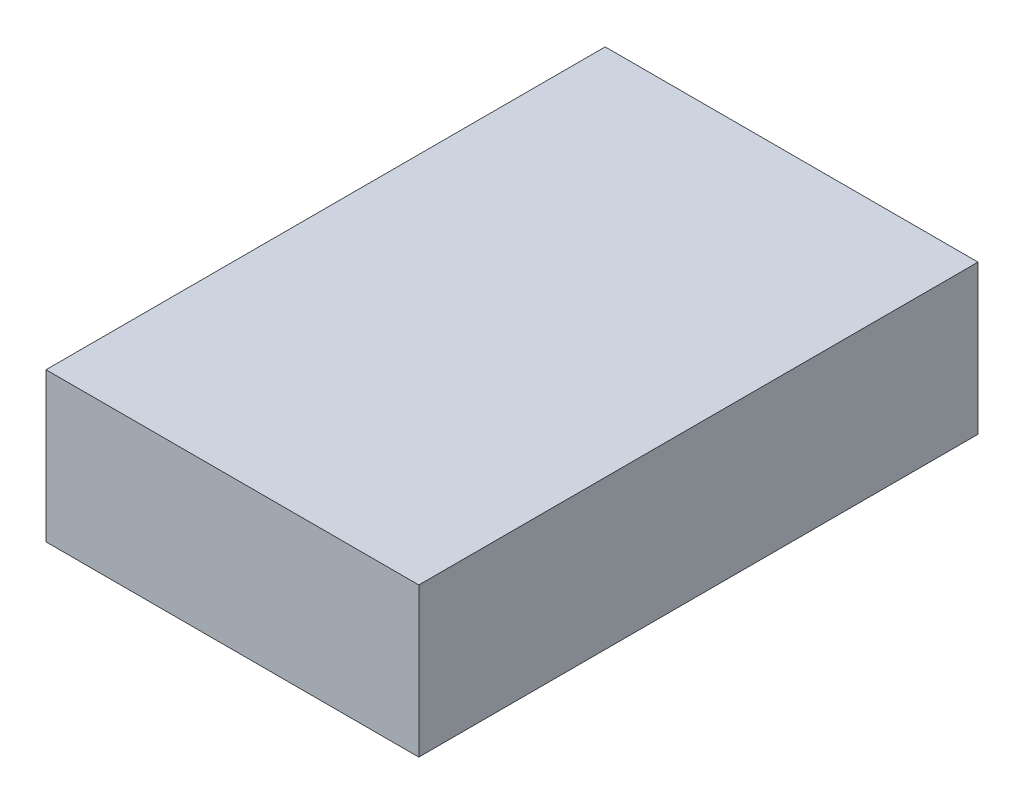
ISO-10303-21;
HEADER;
FILE_DESCRIPTION(('STEP AP214'),'2;1');
FILE_NAME('part.step','',(''),(''),'','','');
FILE_SCHEMA(('AUTOMOTIVE_DESIGN { 1 0 10303 214 1 1 1 1 }'));
ENDSEC;
DATA;
#1=APPLICATION_CONTEXT('core data for automotive mechanical design processes');
#2=APPLICATION_PROTOCOL_DEFINITION('international standard','automotive_design',2000,#1);
#3=PRODUCT_CONTEXT('',#1,'mechanical');
#4=PRODUCT('Part','Part','',(#3));
#5=PRODUCT_RELATED_PRODUCT_CATEGORY('part','',(#4));
#6=PRODUCT_DEFINITION_FORMATION('','',#4);
#7=PRODUCT_DEFINITION_CONTEXT('part definition',#1,'design');
#8=PRODUCT_DEFINITION('design','',#6,#7);
#9=PRODUCT_DEFINITION_SHAPE('','',#8);
#10=(LENGTH_UNIT() NAMED_UNIT(*) SI_UNIT(.MILLI.,.METRE.));
#11=(NAMED_UNIT(*) PLANE_ANGLE_UNIT() SI_UNIT($,.RADIAN.));
#12=(NAMED_UNIT(*) SI_UNIT($,.STERADIAN.) SOLID_ANGLE_UNIT());
#13=UNCERTAINTY_MEASURE_WITH_UNIT(LENGTH_MEASURE(1.E-05),#10,'distance_accuracy_value','');
#14=(GEOMETRIC_REPRESENTATION_CONTEXT(3) GLOBAL_UNCERTAINTY_ASSIGNED_CONTEXT((#13)) GLOBAL_UNIT_ASSIGNED_CONTEXT((#10,
#11,#12)) REPRESENTATION_CONTEXT('',''));
#15=CARTESIAN_POINT('',(0.,0.,0.));
#16=DIRECTION('',(0.,0.,1.));
#17=DIRECTION('',(1.,0.,0.));
#18=AXIS2_PLACEMENT_3D('',#15,#16,#17);
#19=CARTESIAN_POINT('',(1.,0.8,-1.5));
#20=DIRECTION('',(-1.,0.,0.));
#21=DIRECTION('',(0.,0.,1.));
#22=AXIS2_PLACEMENT_3D('',#19,#20,#21);
#23=PLANE('',#22);
#24=DIRECTION('',(0.,0.,-1.));
#25=VECTOR('',#24,1.);
#26=CARTESIAN_POINT('',(1.,0.,-1.5));
#27=LINE('',#26,#25);
#28=CARTESIAN_POINT('',(1.,0.,1.5));
#29=VERTEX_POINT('',#28);
#30=CARTESIAN_POINT('',(1.,0.,-1.5));
#31=VERTEX_POINT('',#30);
#32=EDGE_CURVE('E102',#29,#31,#27,.T.);
#33=ORIENTED_EDGE('',*,*,#32,.T.);
#34=DIRECTION('',(0.,-1.,0.));
#35=VECTOR('',#34,1.);
#36=CARTESIAN_POINT('',(1.,0.8,-1.5));
#37=LINE('',#36,#35);
#38=CARTESIAN_POINT('',(1.,0.8,-1.5));
#39=VERTEX_POINT('',#38);
#40=EDGE_CURVE('E11',#39,#31,#37,.T.);
#41=ORIENTED_EDGE('',*,*,#40,.F.);
#42=DIRECTION('',(0.,0.,-1.));
#43=VECTOR('',#42,1.);
#44=CARTESIAN_POINT('',(1.,0.8,-1.5));
#45=LINE('',#44,#43);
#46=CARTESIAN_POINT('',(1.,0.8,1.5));
#47=VERTEX_POINT('',#46);
#48=EDGE_CURVE('E90',#47,#39,#45,.T.);
#49=ORIENTED_EDGE('',*,*,#48,.F.);
#50=DIRECTION('',(0.,-1.,0.));
#51=VECTOR('',#50,1.);
#52=CARTESIAN_POINT('',(1.,0.8,1.5));
#53=LINE('',#52,#51);
#54=EDGE_CURVE('E98',#47,#29,#53,.T.);
#55=ORIENTED_EDGE('',*,*,#54,.T.);
#56=EDGE_LOOP('',(#33,#41,#49,#55));
#57=FACE_BOUND('',#56,.T.);
#58=ADVANCED_FACE('F39',(#57),#23,.F.);
#59=CARTESIAN_POINT('',(-1.,0.8,-1.5));
#60=DIRECTION('',(0.,0.,1.));
#61=DIRECTION('',(1.,0.,0.));
#62=AXIS2_PLACEMENT_3D('',#59,#60,#61);
#63=PLANE('',#62);
#64=DIRECTION('',(-1.,0.,0.));
#65=VECTOR('',#64,1.);
#66=CARTESIAN_POINT('',(-1.,0.,-1.5));
#67=LINE('',#66,#65);
#68=CARTESIAN_POINT('',(-1.,0.,-1.5));
#69=VERTEX_POINT('',#68);
#70=EDGE_CURVE('E94',#31,#69,#67,.T.);
#71=ORIENTED_EDGE('',*,*,#70,.T.);
#72=DIRECTION('',(0.,-1.,0.));
#73=VECTOR('',#72,1.);
#74=CARTESIAN_POINT('',(-1.,0.8,-1.5));
#75=LINE('',#74,#73);
#76=CARTESIAN_POINT('',(-1.,0.8,-1.5));
#77=VERTEX_POINT('',#76);
#78=EDGE_CURVE('E47',#77,#69,#75,.T.);
#79=ORIENTED_EDGE('',*,*,#78,.F.);
#80=DIRECTION('',(-1.,0.,0.));
#81=VECTOR('',#80,1.);
#82=CARTESIAN_POINT('',(-1.,0.8,-1.5));
#83=LINE('',#82,#81);
#84=EDGE_CURVE('E85',#39,#77,#83,.T.);
#85=ORIENTED_EDGE('',*,*,#84,.F.);
#86=ORIENTED_EDGE('',*,*,#40,.T.);
#87=EDGE_LOOP('',(#71,#79,#85,#86));
#88=FACE_BOUND('',#87,.T.);
#89=ADVANCED_FACE('F93',(#88),#63,.F.);
#90=CARTESIAN_POINT('',(-1.,0.8,-1.5));
#91=DIRECTION('',(1.,0.,0.));
#92=DIRECTION('',(0.,0.,-1.));
#93=AXIS2_PLACEMENT_3D('',#90,#91,#92);
#94=PLANE('',#93);
#95=DIRECTION('',(0.,0.,1.));
#96=VECTOR('',#95,1.);
#97=CARTESIAN_POINT('',(-1.,0.,-1.5));
#98=LINE('',#97,#96);
#99=CARTESIAN_POINT('',(-0.999999999999999,0.,1.5));
#100=VERTEX_POINT('',#99);
#101=EDGE_CURVE('E72',#69,#100,#98,.T.);
#102=ORIENTED_EDGE('',*,*,#101,.T.);
#103=DIRECTION('',(0.,-1.,0.));
#104=VECTOR('',#103,1.);
#105=CARTESIAN_POINT('',(-0.999999999999999,0.8,1.5));
#106=LINE('',#105,#104);
#107=CARTESIAN_POINT('',(-0.999999999999999,0.8,1.5));
#108=VERTEX_POINT('',#107);
#109=EDGE_CURVE('E95',#108,#100,#106,.T.);
#110=ORIENTED_EDGE('',*,*,#109,.F.);
#111=DIRECTION('',(0.,0.,1.));
#112=VECTOR('',#111,1.);
#113=CARTESIAN_POINT('',(-1.,0.8,-1.5));
#114=LINE('',#113,#112);
#115=EDGE_CURVE('E88',#77,#108,#114,.T.);
#116=ORIENTED_EDGE('',*,*,#115,.F.);
#117=ORIENTED_EDGE('',*,*,#78,.T.);
#118=EDGE_LOOP('',(#102,#110,#116,#117));
#119=FACE_BOUND('',#118,.T.);
#120=ADVANCED_FACE('F96',(#119),#94,.F.);
#121=CARTESIAN_POINT('',(-0.999999999999999,0.8,1.5));
#122=DIRECTION('',(0.,0.,-1.));
#123=DIRECTION('',(-1.,0.,0.));
#124=AXIS2_PLACEMENT_3D('',#121,#122,#123);
#125=PLANE('',#124);
#126=DIRECTION('',(1.,0.,0.));
#127=VECTOR('',#126,1.);
#128=CARTESIAN_POINT('',(-0.999999999999999,0.,1.5));
#129=LINE('',#128,#127);
#130=EDGE_CURVE('E78',#100,#29,#129,.T.);
#131=ORIENTED_EDGE('',*,*,#130,.T.);
#132=ORIENTED_EDGE('',*,*,#54,.F.);
#133=DIRECTION('',(1.,0.,0.));
#134=VECTOR('',#133,1.);
#135=CARTESIAN_POINT('',(-0.999999999999999,0.8,1.5));
#136=LINE('',#135,#134);
#137=EDGE_CURVE('E55',#108,#47,#136,.T.);
#138=ORIENTED_EDGE('',*,*,#137,.F.);
#139=ORIENTED_EDGE('',*,*,#109,.T.);
#140=EDGE_LOOP('',(#131,#132,#138,#139));
#141=FACE_BOUND('',#140,.T.);
#142=ADVANCED_FACE('F109',(#141),#125,.F.);
#143=CARTESIAN_POINT('',(0.,0.8,0.));
#144=DIRECTION('',(0.,1.,0.));
#145=DIRECTION('',(0.,0.,1.));
#146=AXIS2_PLACEMENT_3D('',#143,#144,#145);
#147=PLANE('',#146);
#148=ORIENTED_EDGE('',*,*,#48,.T.);
#149=ORIENTED_EDGE('',*,*,#84,.T.);
#150=ORIENTED_EDGE('',*,*,#115,.T.);
#151=ORIENTED_EDGE('',*,*,#137,.T.);
#152=EDGE_LOOP('',(#148,#149,#150,#151));
#153=FACE_BOUND('',#152,.T.);
#154=ADVANCED_FACE('F86',(#153),#147,.T.);
#155=CARTESIAN_POINT('',(0.,0.,0.));
#156=DIRECTION('',(0.,1.,0.));
#157=DIRECTION('',(0.,0.,1.));
#158=AXIS2_PLACEMENT_3D('',#155,#156,#157);
#159=PLANE('',#158);
#160=ORIENTED_EDGE('',*,*,#32,.F.);
#161=ORIENTED_EDGE('',*,*,#130,.F.);
#162=ORIENTED_EDGE('',*,*,#101,.F.);
#163=ORIENTED_EDGE('',*,*,#70,.F.);
#164=EDGE_LOOP('',(#160,#161,#162,#163));
#165=FACE_BOUND('',#164,.T.);
#166=ADVANCED_FACE('F112',(#165),#159,.F.);
#167=CLOSED_SHELL('',(#58,#89,#120,#142,#154,#166));
#168=MANIFOLD_SOLID_BREP('B2',#167);
#169=ADVANCED_BREP_SHAPE_REPRESENTATION('',(#18,#168),#14);
#170=SHAPE_DEFINITION_REPRESENTATION(#9,#169);
ENDSEC;
END-ISO-10303-21;
